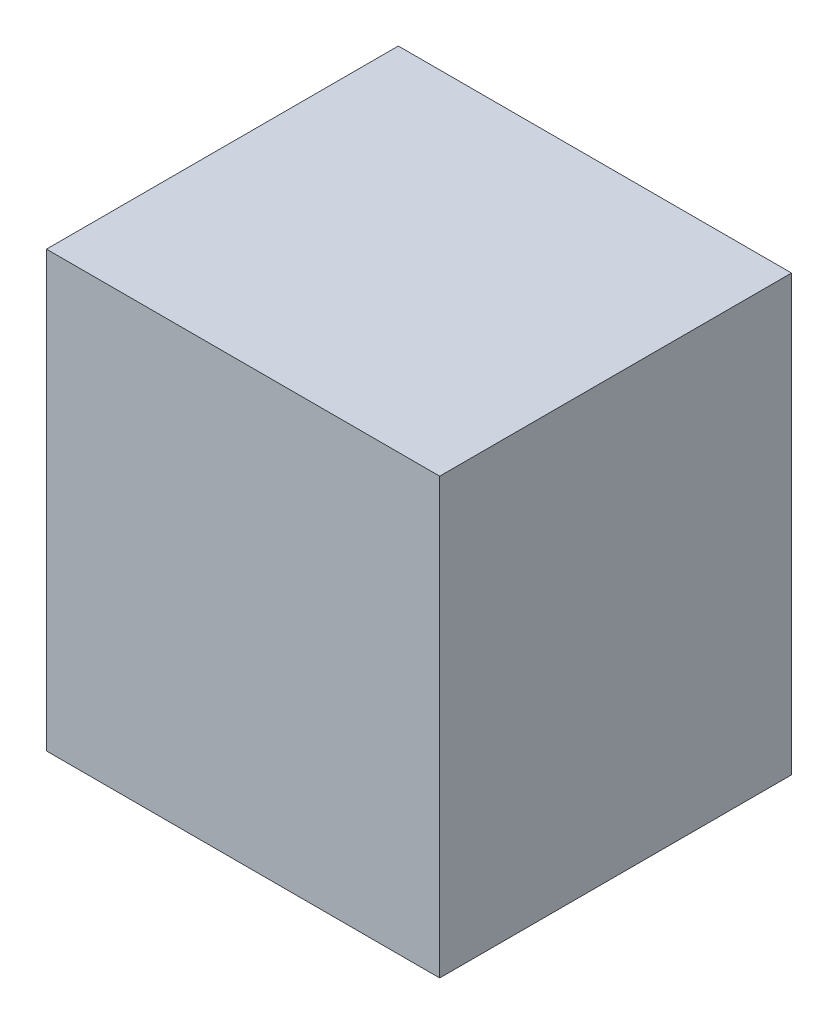
ISO-10303-21;
HEADER;
FILE_DESCRIPTION(('STEP AP214'),'2;1');
FILE_NAME('part.step','',(''),(''),'','','');
FILE_SCHEMA(('AUTOMOTIVE_DESIGN { 1 0 10303 214 1 1 1 1 }'));
ENDSEC;
DATA;
#1=APPLICATION_CONTEXT('core data for automotive mechanical design processes');
#2=APPLICATION_PROTOCOL_DEFINITION('international standard','automotive_design',2000,#1);
#3=PRODUCT_CONTEXT('',#1,'mechanical');
#4=PRODUCT('Part','Part','',(#3));
#5=PRODUCT_RELATED_PRODUCT_CATEGORY('part','',(#4));
#6=PRODUCT_DEFINITION_FORMATION('','',#4);
#7=PRODUCT_DEFINITION_CONTEXT('part definition',#1,'design');
#8=PRODUCT_DEFINITION('design','',#6,#7);
#9=PRODUCT_DEFINITION_SHAPE('','',#8);
#10=(LENGTH_UNIT() NAMED_UNIT(*) SI_UNIT(.MILLI.,.METRE.));
#11=(NAMED_UNIT(*) PLANE_ANGLE_UNIT() SI_UNIT($,.RADIAN.));
#12=(NAMED_UNIT(*) SI_UNIT($,.STERADIAN.) SOLID_ANGLE_UNIT());
#13=UNCERTAINTY_MEASURE_WITH_UNIT(LENGTH_MEASURE(1.E-05),#10,'distance_accuracy_value','');
#14=(GEOMETRIC_REPRESENTATION_CONTEXT(3) GLOBAL_UNCERTAINTY_ASSIGNED_CONTEXT((#13)) GLOBAL_UNIT_ASSIGNED_CONTEXT((#10,
#11,#12)) REPRESENTATION_CONTEXT('',''));
#15=CARTESIAN_POINT('',(0.,0.,0.));
#16=DIRECTION('',(0.,0.,1.));
#17=DIRECTION('',(1.,0.,0.));
#18=AXIS2_PLACEMENT_3D('',#15,#16,#17);
#19=CARTESIAN_POINT('',(-0.47499778,-0.52500022,0.));
#20=DIRECTION('',(0.,1.,0.));
#21=DIRECTION('',(1.,0.,0.));
#22=AXIS2_PLACEMENT_3D('',#19,#20,#21);
#23=PLANE('',#22);
#24=DIRECTION('',(1.,0.,0.));
#25=VECTOR('',#24,1.);
#26=CARTESIAN_POINT('',(-0.47499778,-0.52500022,0.));
#27=LINE('',#26,#25);
#28=CARTESIAN_POINT('',(-0.47499778,-0.52500022,0.));
#29=VERTEX_POINT('',#28);
#30=CARTESIAN_POINT('',(0.47500032,-0.52500022,0.));
#31=VERTEX_POINT('',#30);
#32=EDGE_CURVE('E11',#29,#31,#27,.T.);
#33=ORIENTED_EDGE('',*,*,#32,.T.);
#34=DIRECTION('',(0.,0.,1.));
#35=VECTOR('',#34,1.);
#36=CARTESIAN_POINT('',(0.47500032,-0.52500022,0.));
#37=LINE('',#36,#35);
#38=CARTESIAN_POINT('',(0.47500032,-0.52500022,0.85000084));
#39=VERTEX_POINT('',#38);
#40=EDGE_CURVE('E24',#31,#39,#37,.T.);
#41=ORIENTED_EDGE('',*,*,#40,.T.);
#42=DIRECTION('',(1.,0.,0.));
#43=VECTOR('',#42,1.);
#44=CARTESIAN_POINT('',(-0.47499778,-0.52500022,0.85000084));
#45=LINE('',#44,#43);
#46=CARTESIAN_POINT('',(-0.47499778,-0.52500022,0.85000084));
#47=VERTEX_POINT('',#46);
#48=EDGE_CURVE('E87',#47,#39,#45,.T.);
#49=ORIENTED_EDGE('',*,*,#48,.F.);
#50=DIRECTION('',(0.,0.,1.));
#51=VECTOR('',#50,1.);
#52=CARTESIAN_POINT('',(-0.47499778,-0.52500022,0.));
#53=LINE('',#52,#51);
#54=EDGE_CURVE('E36',#29,#47,#53,.T.);
#55=ORIENTED_EDGE('',*,*,#54,.F.);
#56=EDGE_LOOP('',(#33,#41,#49,#55));
#57=FACE_BOUND('',#56,.T.);
#58=ADVANCED_FACE('F17',(#57),#23,.F.);
#59=CARTESIAN_POINT('',(0.47500032,-0.52500022,0.));
#60=DIRECTION('',(-1.,0.,0.));
#61=DIRECTION('',(0.,1.,0.));
#62=AXIS2_PLACEMENT_3D('',#59,#60,#61);
#63=PLANE('',#62);
#64=DIRECTION('',(0.,1.,0.));
#65=VECTOR('',#64,1.);
#66=CARTESIAN_POINT('',(0.47500032,-0.52500022,0.));
#67=LINE('',#66,#65);
#68=CARTESIAN_POINT('',(0.47500032,0.52500022,0.));
#69=VERTEX_POINT('',#68);
#70=EDGE_CURVE('E84',#31,#69,#67,.T.);
#71=ORIENTED_EDGE('',*,*,#70,.T.);
#72=DIRECTION('',(0.,0.,1.));
#73=VECTOR('',#72,1.);
#74=CARTESIAN_POINT('',(0.47500032,0.52500022,0.));
#75=LINE('',#74,#73);
#76=CARTESIAN_POINT('',(0.47500032,0.52500022,0.85000084));
#77=VERTEX_POINT('',#76);
#78=EDGE_CURVE('E82',#69,#77,#75,.T.);
#79=ORIENTED_EDGE('',*,*,#78,.T.);
#80=DIRECTION('',(0.,1.,0.));
#81=VECTOR('',#80,1.);
#82=CARTESIAN_POINT('',(0.47500032,-0.52500022,0.85000084));
#83=LINE('',#82,#81);
#84=EDGE_CURVE('E62',#39,#77,#83,.T.);
#85=ORIENTED_EDGE('',*,*,#84,.F.);
#86=ORIENTED_EDGE('',*,*,#40,.F.);
#87=EDGE_LOOP('',(#71,#79,#85,#86));
#88=FACE_BOUND('',#87,.T.);
#89=ADVANCED_FACE('F89',(#88),#63,.F.);
#90=CARTESIAN_POINT('',(0.47500032,0.52500022,0.));
#91=DIRECTION('',(0.,-1.,0.));
#92=DIRECTION('',(-1.,0.,0.));
#93=AXIS2_PLACEMENT_3D('',#90,#91,#92);
#94=PLANE('',#93);
#95=DIRECTION('',(-1.,0.,0.));
#96=VECTOR('',#95,1.);
#97=CARTESIAN_POINT('',(0.47500032,0.52500022,0.));
#98=LINE('',#97,#96);
#99=CARTESIAN_POINT('',(-0.47499778,0.52500022,0.));
#100=VERTEX_POINT('',#99);
#101=EDGE_CURVE('E71',#69,#100,#98,.T.);
#102=ORIENTED_EDGE('',*,*,#101,.T.);
#103=DIRECTION('',(0.,0.,1.));
#104=VECTOR('',#103,1.);
#105=CARTESIAN_POINT('',(-0.47499778,0.52500022,0.));
#106=LINE('',#105,#104);
#107=CARTESIAN_POINT('',(-0.47499778,0.52500022,0.85000084));
#108=VERTEX_POINT('',#107);
#109=EDGE_CURVE('E65',#100,#108,#106,.T.);
#110=ORIENTED_EDGE('',*,*,#109,.T.);
#111=DIRECTION('',(-1.,0.,0.));
#112=VECTOR('',#111,1.);
#113=CARTESIAN_POINT('',(0.47500032,0.52500022,0.85000084));
#114=LINE('',#113,#112);
#115=EDGE_CURVE('E57',#77,#108,#114,.T.);
#116=ORIENTED_EDGE('',*,*,#115,.F.);
#117=ORIENTED_EDGE('',*,*,#78,.F.);
#118=EDGE_LOOP('',(#102,#110,#116,#117));
#119=FACE_BOUND('',#118,.T.);
#120=ADVANCED_FACE('F69',(#119),#94,.F.);
#121=CARTESIAN_POINT('',(-0.47499778,0.52500022,0.));
#122=DIRECTION('',(1.,0.,0.));
#123=DIRECTION('',(0.,-1.,0.));
#124=AXIS2_PLACEMENT_3D('',#121,#122,#123);
#125=PLANE('',#124);
#126=DIRECTION('',(0.,-1.,0.));
#127=VECTOR('',#126,1.);
#128=CARTESIAN_POINT('',(-0.47499778,0.52500022,0.));
#129=LINE('',#128,#127);
#130=EDGE_CURVE('E66',#100,#29,#129,.T.);
#131=ORIENTED_EDGE('',*,*,#130,.T.);
#132=ORIENTED_EDGE('',*,*,#54,.T.);
#133=DIRECTION('',(0.,-1.,0.));
#134=VECTOR('',#133,1.);
#135=CARTESIAN_POINT('',(-0.47499778,0.52500022,0.85000084));
#136=LINE('',#135,#134);
#137=EDGE_CURVE('E61',#108,#47,#136,.T.);
#138=ORIENTED_EDGE('',*,*,#137,.F.);
#139=ORIENTED_EDGE('',*,*,#109,.F.);
#140=EDGE_LOOP('',(#131,#132,#138,#139));
#141=FACE_BOUND('',#140,.T.);
#142=ADVANCED_FACE('F76',(#141),#125,.F.);
#143=CARTESIAN_POINT('',(-0.47499778,-0.52500022,0.));
#144=DIRECTION('',(0.,0.,-1.));
#145=DIRECTION('',(-1.,0.,0.));
#146=AXIS2_PLACEMENT_3D('',#143,#144,#145);
#147=PLANE('',#146);
#148=ORIENTED_EDGE('',*,*,#130,.F.);
#149=ORIENTED_EDGE('',*,*,#101,.F.);
#150=ORIENTED_EDGE('',*,*,#70,.F.);
#151=ORIENTED_EDGE('',*,*,#32,.F.);
#152=EDGE_LOOP('',(#148,#149,#150,#151));
#153=FACE_BOUND('',#152,.T.);
#154=ADVANCED_FACE('F91',(#153),#147,.T.);
#155=CARTESIAN_POINT('',(-0.47499778,-0.52500022,0.85000084));
#156=DIRECTION('',(0.,0.,-1.));
#157=DIRECTION('',(-1.,0.,0.));
#158=AXIS2_PLACEMENT_3D('',#155,#156,#157);
#159=PLANE('',#158);
#160=ORIENTED_EDGE('',*,*,#48,.T.);
#161=ORIENTED_EDGE('',*,*,#84,.T.);
#162=ORIENTED_EDGE('',*,*,#115,.T.);
#163=ORIENTED_EDGE('',*,*,#137,.T.);
#164=EDGE_LOOP('',(#160,#161,#162,#163));
#165=FACE_BOUND('',#164,.T.);
#166=ADVANCED_FACE('F59',(#165),#159,.F.);
#167=CLOSED_SHELL('',(#58,#89,#120,#142,#154,#166));
#168=MANIFOLD_SOLID_BREP('B1',#167);
#169=ADVANCED_BREP_SHAPE_REPRESENTATION('',(#18,#168),#14);
#170=SHAPE_DEFINITION_REPRESENTATION(#9,#169);
ENDSEC;
END-ISO-10303-21;
